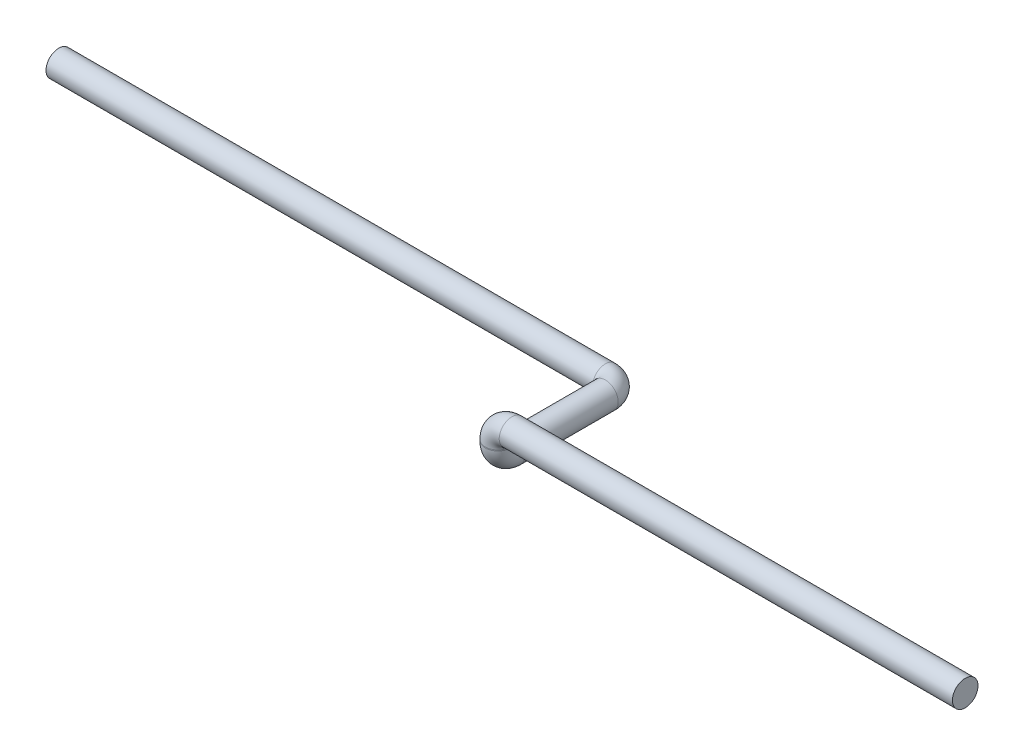
ISO-10303-21;
HEADER;
FILE_DESCRIPTION(('STEP AP214'),'2;1');
FILE_NAME('part.step','',(''),(''),'','','');
FILE_SCHEMA(('AUTOMOTIVE_DESIGN { 1 0 10303 214 1 1 1 1 }'));
ENDSEC;
DATA;
#1=APPLICATION_CONTEXT('core data for automotive mechanical design processes');
#2=APPLICATION_PROTOCOL_DEFINITION('international standard','automotive_design',2000,#1);
#3=PRODUCT_CONTEXT('',#1,'mechanical');
#4=PRODUCT('Part','Part','',(#3));
#5=PRODUCT_RELATED_PRODUCT_CATEGORY('part','',(#4));
#6=PRODUCT_DEFINITION_FORMATION('','',#4);
#7=PRODUCT_DEFINITION_CONTEXT('part definition',#1,'design');
#8=PRODUCT_DEFINITION('design','',#6,#7);
#9=PRODUCT_DEFINITION_SHAPE('','',#8);
#10=(LENGTH_UNIT() NAMED_UNIT(*) SI_UNIT(.MILLI.,.METRE.));
#11=(NAMED_UNIT(*) PLANE_ANGLE_UNIT() SI_UNIT($,.RADIAN.));
#12=(NAMED_UNIT(*) SI_UNIT($,.STERADIAN.) SOLID_ANGLE_UNIT());
#13=UNCERTAINTY_MEASURE_WITH_UNIT(LENGTH_MEASURE(1.E-05),#10,'distance_accuracy_value','');
#14=(GEOMETRIC_REPRESENTATION_CONTEXT(3) GLOBAL_UNCERTAINTY_ASSIGNED_CONTEXT((#13)) GLOBAL_UNIT_ASSIGNED_CONTEXT((#10,
#11,#12)) REPRESENTATION_CONTEXT('',''));
#15=CARTESIAN_POINT('',(0.,0.,0.));
#16=DIRECTION('',(0.,0.,1.));
#17=DIRECTION('',(1.,0.,0.));
#18=AXIS2_PLACEMENT_3D('',#15,#16,#17);
#19=CARTESIAN_POINT('',(0.,0.,0.));
#20=DIRECTION('',(1.,0.,0.));
#21=DIRECTION('',(0.,0.,-1.));
#22=AXIS2_PLACEMENT_3D('',#19,#20,#21);
#23=PLANE('',#22);
#24=CARTESIAN_POINT('',(0.,0.,0.));
#25=DIRECTION('',(1.,0.,0.));
#26=DIRECTION('',(0.,0.,-1.));
#27=AXIS2_PLACEMENT_3D('',#24,#25,#26);
#28=CIRCLE('',#27,13.7);
#29=CARTESIAN_POINT('',(0.,0.,-13.7));
#30=VERTEX_POINT('',#29);
#31=EDGE_CURVE('E47',#30,#30,#28,.T.);
#32=ORIENTED_EDGE('',*,*,#31,.T.);
#33=EDGE_LOOP('',(#32));
#34=FACE_BOUND('',#33,.T.);
#35=ADVANCED_FACE('F35',(#34),#23,.T.);
#36=CARTESIAN_POINT('',(-1100.,-31.,-130.));
#37=DIRECTION('',(1.,0.,0.));
#38=DIRECTION('',(0.,1.,0.));
#39=AXIS2_PLACEMENT_3D('',#36,#37,#38);
#40=PLANE('',#39);
#41=CARTESIAN_POINT('',(-1100.,-31.,-130.));
#42=DIRECTION('',(1.,0.,0.));
#43=DIRECTION('',(0.,1.,0.));
#44=AXIS2_PLACEMENT_3D('',#41,#42,#43);
#45=CIRCLE('',#44,13.7);
#46=CARTESIAN_POINT('',(-1100.,-17.3,-130.));
#47=VERTEX_POINT('',#46);
#48=EDGE_CURVE('E11',#47,#47,#45,.T.);
#49=ORIENTED_EDGE('',*,*,#48,.F.);
#50=EDGE_LOOP('',(#49));
#51=FACE_BOUND('',#50,.T.);
#52=ADVANCED_FACE('F53',(#51),#40,.F.);
#53=CARTESIAN_POINT('',(0.,0.,0.));
#54=DIRECTION('',(-1.,0.,0.));
#55=DIRECTION('',(0.,0.,1.));
#56=AXIS2_PLACEMENT_3D('',#53,#54,#55);
#57=CYLINDRICAL_SURFACE('',#56,13.7);
#58=CARTESIAN_POINT('',(-485.,0.,0.));
#59=DIRECTION('',(1.,0.,0.));
#60=DIRECTION('',(0.,0.,-1.));
#61=AXIS2_PLACEMENT_3D('',#58,#59,#60);
#62=CIRCLE('',#61,13.7);
#63=CARTESIAN_POINT('',(-485.,13.7,0.));
#64=VERTEX_POINT('',#63);
#65=EDGE_CURVE('E95',#64,#64,#62,.T.);
#66=ORIENTED_EDGE('',*,*,#65,.T.);
#67=EDGE_LOOP('',(#66));
#68=FACE_BOUND('',#67,.T.);
#69=ORIENTED_EDGE('',*,*,#31,.F.);
#70=EDGE_LOOP('',(#69));
#71=FACE_BOUND('',#70,.T.);
#72=ADVANCED_FACE('F55',(#68,#71),#57,.T.);
#73=CARTESIAN_POINT('',(-485.,-15.,0.));
#74=DIRECTION('',(0.,0.,1.));
#75=DIRECTION('',(1.,0.,0.));
#76=AXIS2_PLACEMENT_3D('',#73,#74,#75);
#77=TOROIDAL_SURFACE('',#76,15.,13.7);
#78=CARTESIAN_POINT('',(-500.,-15.,0.));
#79=DIRECTION('',(0.,1.,0.));
#80=DIRECTION('',(0.,0.,-1.));
#81=AXIS2_PLACEMENT_3D('',#78,#79,#80);
#82=CIRCLE('',#81,13.7);
#83=CARTESIAN_POINT('',(-513.7,-15.,0.));
#84=VERTEX_POINT('',#83);
#85=EDGE_CURVE('E92',#84,#84,#82,.T.);
#86=CARTESIAN_POINT('',(-485.,-15.,0.));
#87=DIRECTION('',(0.,0.,1.));
#88=DIRECTION('',(1.,0.,0.));
#89=AXIS2_PLACEMENT_3D('',#86,#87,#88);
#90=CIRCLE('',#89,28.7);
#91=EDGE_CURVE('',#64,#84,#90,.T.);
#92=ORIENTED_EDGE('',*,*,#65,.F.);
#93=ORIENTED_EDGE('',*,*,#85,.T.);
#94=ORIENTED_EDGE('',*,*,#91,.T.);
#95=ORIENTED_EDGE('',*,*,#91,.F.);
#96=EDGE_LOOP('',(#92,#94,#93,#95));
#97=FACE_BOUND('',#96,.T.);
#98=ADVANCED_FACE('F60',(#97),#77,.T.);
#99=CARTESIAN_POINT('',(-500.,-15.,0.));
#100=DIRECTION('',(0.,-1.,0.));
#101=DIRECTION('',(0.,0.,-1.));
#102=AXIS2_PLACEMENT_3D('',#99,#100,#101);
#103=CYLINDRICAL_SURFACE('',#102,13.7);
#104=CARTESIAN_POINT('',(-500.,-16.,0.));
#105=DIRECTION('',(0.,1.,0.));
#106=DIRECTION('',(0.,0.,-1.));
#107=AXIS2_PLACEMENT_3D('',#104,#105,#106);
#108=CIRCLE('',#107,13.7);
#109=CARTESIAN_POINT('',(-500.,-16.,13.7));
#110=VERTEX_POINT('',#109);
#111=EDGE_CURVE('E97',#110,#110,#108,.T.);
#112=ORIENTED_EDGE('',*,*,#111,.T.);
#113=EDGE_LOOP('',(#112));
#114=FACE_BOUND('',#113,.T.);
#115=ORIENTED_EDGE('',*,*,#85,.F.);
#116=EDGE_LOOP('',(#115));
#117=FACE_BOUND('',#116,.T.);
#118=ADVANCED_FACE('F80',(#114,#117),#103,.T.);
#119=CARTESIAN_POINT('',(-500.,-16.,-15.));
#120=DIRECTION('',(1.,0.,0.));
#121=DIRECTION('',(0.,0.,-1.));
#122=AXIS2_PLACEMENT_3D('',#119,#120,#121);
#123=TOROIDAL_SURFACE('',#122,15.,13.7);
#124=CARTESIAN_POINT('',(-500.,-31.,-15.));
#125=DIRECTION('',(0.,0.,1.));
#126=DIRECTION('',(0.,1.,0.));
#127=AXIS2_PLACEMENT_3D('',#124,#125,#126);
#128=CIRCLE('',#127,13.7);
#129=CARTESIAN_POINT('',(-500.,-44.7,-15.));
#130=VERTEX_POINT('',#129);
#131=EDGE_CURVE('E103',#130,#130,#128,.T.);
#132=CARTESIAN_POINT('',(-500.,-16.,-15.));
#133=DIRECTION('',(1.,0.,0.));
#134=DIRECTION('',(0.,0.,-1.));
#135=AXIS2_PLACEMENT_3D('',#132,#133,#134);
#136=CIRCLE('',#135,28.7);
#137=EDGE_CURVE('',#110,#130,#136,.T.);
#138=ORIENTED_EDGE('',*,*,#111,.F.);
#139=ORIENTED_EDGE('',*,*,#131,.T.);
#140=ORIENTED_EDGE('',*,*,#137,.T.);
#141=ORIENTED_EDGE('',*,*,#137,.F.);
#142=EDGE_LOOP('',(#138,#140,#139,#141));
#143=FACE_BOUND('',#142,.T.);
#144=ADVANCED_FACE('F76',(#143),#123,.T.);
#145=CARTESIAN_POINT('',(-500.,-31.,-15.));
#146=DIRECTION('',(0.,0.,-1.));
#147=DIRECTION('',(-1.,0.,0.));
#148=AXIS2_PLACEMENT_3D('',#145,#146,#147);
#149=CYLINDRICAL_SURFACE('',#148,13.7);
#150=CARTESIAN_POINT('',(-500.,-31.,-115.));
#151=DIRECTION('',(0.,0.,1.));
#152=DIRECTION('',(0.,1.,0.));
#153=AXIS2_PLACEMENT_3D('',#150,#151,#152);
#154=CIRCLE('',#153,13.7);
#155=CARTESIAN_POINT('',(-486.3,-31.,-115.));
#156=VERTEX_POINT('',#155);
#157=EDGE_CURVE('E106',#156,#156,#154,.T.);
#158=ORIENTED_EDGE('',*,*,#157,.T.);
#159=EDGE_LOOP('',(#158));
#160=FACE_BOUND('',#159,.T.);
#161=ORIENTED_EDGE('',*,*,#131,.F.);
#162=EDGE_LOOP('',(#161));
#163=FACE_BOUND('',#162,.T.);
#164=ADVANCED_FACE('F70',(#160,#163),#149,.T.);
#165=CARTESIAN_POINT('',(-515.,-31.,-115.));
#166=DIRECTION('',(0.,1.,0.));
#167=DIRECTION('',(0.,0.,1.));
#168=AXIS2_PLACEMENT_3D('',#165,#166,#167);
#169=TOROIDAL_SURFACE('',#168,15.,13.7);
#170=CARTESIAN_POINT('',(-515.,-31.,-130.));
#171=DIRECTION('',(1.,0.,0.));
#172=DIRECTION('',(0.,1.,0.));
#173=AXIS2_PLACEMENT_3D('',#170,#171,#172);
#174=CIRCLE('',#173,13.7);
#175=CARTESIAN_POINT('',(-515.,-31.,-143.7));
#176=VERTEX_POINT('',#175);
#177=EDGE_CURVE('E42',#176,#176,#174,.T.);
#178=CARTESIAN_POINT('',(-515.,-31.,-115.));
#179=DIRECTION('',(0.,1.,0.));
#180=DIRECTION('',(0.,0.,1.));
#181=AXIS2_PLACEMENT_3D('',#178,#179,#180);
#182=CIRCLE('',#181,28.7);
#183=EDGE_CURVE('',#156,#176,#182,.T.);
#184=ORIENTED_EDGE('',*,*,#157,.F.);
#185=ORIENTED_EDGE('',*,*,#177,.T.);
#186=ORIENTED_EDGE('',*,*,#183,.T.);
#187=ORIENTED_EDGE('',*,*,#183,.F.);
#188=EDGE_LOOP('',(#184,#186,#185,#187));
#189=FACE_BOUND('',#188,.T.);
#190=ADVANCED_FACE('F66',(#189),#169,.T.);
#191=CARTESIAN_POINT('',(-515.,-31.,-130.));
#192=DIRECTION('',(-1.,0.,0.));
#193=DIRECTION('',(0.,0.,1.));
#194=AXIS2_PLACEMENT_3D('',#191,#192,#193);
#195=CYLINDRICAL_SURFACE('',#194,13.7);
#196=ORIENTED_EDGE('',*,*,#48,.T.);
#197=EDGE_LOOP('',(#196));
#198=FACE_BOUND('',#197,.T.);
#199=ORIENTED_EDGE('',*,*,#177,.F.);
#200=EDGE_LOOP('',(#199));
#201=FACE_BOUND('',#200,.T.);
#202=ADVANCED_FACE('F50',(#198,#201),#195,.T.);
#203=CLOSED_SHELL('',(#35,#52,#72,#98,#118,#144,#164,#190,#202));
#204=MANIFOLD_SOLID_BREP('B2',#203);
#205=ADVANCED_BREP_SHAPE_REPRESENTATION('',(#18,#204),#14);
#206=SHAPE_DEFINITION_REPRESENTATION(#9,#205);
ENDSEC;
END-ISO-10303-21;
